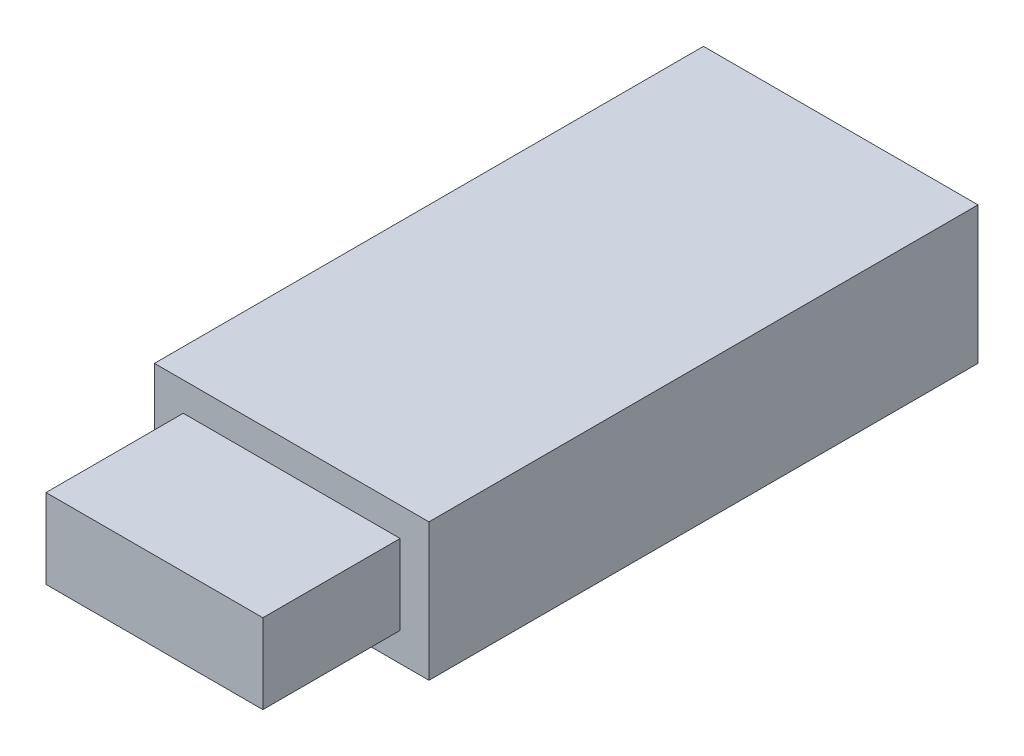
ISO-10303-21;
HEADER;
FILE_DESCRIPTION(('STEP AP214'),'2;1');
FILE_NAME('part.step','',(''),(''),'','','');
FILE_SCHEMA(('AUTOMOTIVE_DESIGN { 1 0 10303 214 1 1 1 1 }'));
ENDSEC;
DATA;
#1=APPLICATION_CONTEXT('core data for automotive mechanical design processes');
#2=APPLICATION_PROTOCOL_DEFINITION('international standard','automotive_design',2000,#1);
#3=PRODUCT_CONTEXT('',#1,'mechanical');
#4=PRODUCT('Part','Part','',(#3));
#5=PRODUCT_RELATED_PRODUCT_CATEGORY('part','',(#4));
#6=PRODUCT_DEFINITION_FORMATION('','',#4);
#7=PRODUCT_DEFINITION_CONTEXT('part definition',#1,'design');
#8=PRODUCT_DEFINITION('design','',#6,#7);
#9=PRODUCT_DEFINITION_SHAPE('','',#8);
#10=(LENGTH_UNIT() NAMED_UNIT(*) SI_UNIT(.MILLI.,.METRE.));
#11=(NAMED_UNIT(*) PLANE_ANGLE_UNIT() SI_UNIT($,.RADIAN.));
#12=(NAMED_UNIT(*) SI_UNIT($,.STERADIAN.) SOLID_ANGLE_UNIT());
#13=UNCERTAINTY_MEASURE_WITH_UNIT(LENGTH_MEASURE(1.E-05),#10,'distance_accuracy_value','');
#14=(GEOMETRIC_REPRESENTATION_CONTEXT(3) GLOBAL_UNCERTAINTY_ASSIGNED_CONTEXT((#13)) GLOBAL_UNIT_ASSIGNED_CONTEXT((#10,
#11,#12)) REPRESENTATION_CONTEXT('',''));
#15=CARTESIAN_POINT('',(0.,0.,0.));
#16=DIRECTION('',(0.,0.,1.));
#17=DIRECTION('',(1.,0.,0.));
#18=AXIS2_PLACEMENT_3D('',#15,#16,#17);
#19=CARTESIAN_POINT('',(-20.,10.,100.));
#20=DIRECTION('',(1.,0.,0.));
#21=DIRECTION('',(0.,1.,0.));
#22=AXIS2_PLACEMENT_3D('',#19,#20,#21);
#23=PLANE('',#22);
#24=DIRECTION('',(0.,-1.,0.));
#25=VECTOR('',#24,1.);
#26=CARTESIAN_POINT('',(-20.,0.,80.));
#27=LINE('',#26,#25);
#28=CARTESIAN_POINT('',(-20.,10.,80.));
#29=VERTEX_POINT('',#28);
#30=CARTESIAN_POINT('',(-20.,-10.,80.));
#31=VERTEX_POINT('',#30);
#32=EDGE_CURVE('E98',#29,#31,#27,.T.);
#33=ORIENTED_EDGE('',*,*,#32,.F.);
#34=DIRECTION('',(0.,0.,-1.));
#35=VECTOR('',#34,1.);
#36=CARTESIAN_POINT('',(-20.,10.,100.));
#37=LINE('',#36,#35);
#38=CARTESIAN_POINT('',(-20.,10.,0.));
#39=VERTEX_POINT('',#38);
#40=EDGE_CURVE('E108',#29,#39,#37,.T.);
#41=ORIENTED_EDGE('',*,*,#40,.T.);
#42=DIRECTION('',(0.,-1.,0.));
#43=VECTOR('',#42,1.);
#44=CARTESIAN_POINT('',(-20.,10.,0.));
#45=LINE('',#44,#43);
#46=CARTESIAN_POINT('',(-20.,-10.,0.));
#47=VERTEX_POINT('',#46);
#48=EDGE_CURVE('E133',#39,#47,#45,.T.);
#49=ORIENTED_EDGE('',*,*,#48,.T.);
#50=DIRECTION('',(0.,0.,-1.));
#51=VECTOR('',#50,1.);
#52=CARTESIAN_POINT('',(-20.,-10.,100.));
#53=LINE('',#52,#51);
#54=EDGE_CURVE('E11',#31,#47,#53,.T.);
#55=ORIENTED_EDGE('',*,*,#54,.F.);
#56=EDGE_LOOP('',(#33,#41,#49,#55));
#57=FACE_BOUND('',#56,.T.);
#58=ADVANCED_FACE('F34',(#57),#23,.F.);
#59=CARTESIAN_POINT('',(-20.,-10.,100.));
#60=DIRECTION('',(0.,1.,0.));
#61=DIRECTION('',(0.,0.,1.));
#62=AXIS2_PLACEMENT_3D('',#59,#60,#61);
#63=PLANE('',#62);
#64=DIRECTION('',(1.,0.,0.));
#65=VECTOR('',#64,1.);
#66=CARTESIAN_POINT('',(0.,-10.,80.));
#67=LINE('',#66,#65);
#68=CARTESIAN_POINT('',(20.,-10.,80.));
#69=VERTEX_POINT('',#68);
#70=EDGE_CURVE('E110',#31,#69,#67,.T.);
#71=ORIENTED_EDGE('',*,*,#70,.F.);
#72=ORIENTED_EDGE('',*,*,#54,.T.);
#73=DIRECTION('',(1.,0.,0.));
#74=VECTOR('',#73,1.);
#75=CARTESIAN_POINT('',(-20.,-10.,0.));
#76=LINE('',#75,#74);
#77=CARTESIAN_POINT('',(20.,-10.,0.));
#78=VERTEX_POINT('',#77);
#79=EDGE_CURVE('E130',#47,#78,#76,.T.);
#80=ORIENTED_EDGE('',*,*,#79,.T.);
#81=DIRECTION('',(0.,0.,-1.));
#82=VECTOR('',#81,1.);
#83=CARTESIAN_POINT('',(20.,-10.,100.));
#84=LINE('',#83,#82);
#85=EDGE_CURVE('E41',#69,#78,#84,.T.);
#86=ORIENTED_EDGE('',*,*,#85,.F.);
#87=EDGE_LOOP('',(#71,#72,#80,#86));
#88=FACE_BOUND('',#87,.T.);
#89=ADVANCED_FACE('F131',(#88),#63,.F.);
#90=CARTESIAN_POINT('',(20.,10.,100.));
#91=DIRECTION('',(-1.,0.,0.));
#92=DIRECTION('',(0.,-1.,0.));
#93=AXIS2_PLACEMENT_3D('',#90,#91,#92);
#94=PLANE('',#93);
#95=DIRECTION('',(0.,1.,0.));
#96=VECTOR('',#95,1.);
#97=CARTESIAN_POINT('',(20.,0.,80.));
#98=LINE('',#97,#96);
#99=CARTESIAN_POINT('',(20.,10.,80.));
#100=VERTEX_POINT('',#99);
#101=EDGE_CURVE('E48',#69,#100,#98,.T.);
#102=ORIENTED_EDGE('',*,*,#101,.F.);
#103=ORIENTED_EDGE('',*,*,#85,.T.);
#104=DIRECTION('',(0.,1.,0.));
#105=VECTOR('',#104,1.);
#106=CARTESIAN_POINT('',(20.,10.,0.));
#107=LINE('',#106,#105);
#108=CARTESIAN_POINT('',(20.,10.,0.));
#109=VERTEX_POINT('',#108);
#110=EDGE_CURVE('E119',#78,#109,#107,.T.);
#111=ORIENTED_EDGE('',*,*,#110,.T.);
#112=DIRECTION('',(0.,0.,-1.));
#113=VECTOR('',#112,1.);
#114=CARTESIAN_POINT('',(20.,10.,100.));
#115=LINE('',#114,#113);
#116=EDGE_CURVE('E116',#100,#109,#115,.T.);
#117=ORIENTED_EDGE('',*,*,#116,.F.);
#118=EDGE_LOOP('',(#102,#103,#111,#117));
#119=FACE_BOUND('',#118,.T.);
#120=ADVANCED_FACE('F126',(#119),#94,.F.);
#121=CARTESIAN_POINT('',(-20.,10.,100.));
#122=DIRECTION('',(0.,-1.,0.));
#123=DIRECTION('',(0.,0.,-1.));
#124=AXIS2_PLACEMENT_3D('',#121,#122,#123);
#125=PLANE('',#124);
#126=DIRECTION('',(-1.,0.,0.));
#127=VECTOR('',#126,1.);
#128=CARTESIAN_POINT('',(0.,10.,80.));
#129=LINE('',#128,#127);
#130=EDGE_CURVE('E94',#100,#29,#129,.T.);
#131=ORIENTED_EDGE('',*,*,#130,.F.);
#132=ORIENTED_EDGE('',*,*,#116,.T.);
#133=DIRECTION('',(-1.,0.,0.));
#134=VECTOR('',#133,1.);
#135=CARTESIAN_POINT('',(-20.,10.,0.));
#136=LINE('',#135,#134);
#137=EDGE_CURVE('E114',#109,#39,#136,.T.);
#138=ORIENTED_EDGE('',*,*,#137,.T.);
#139=ORIENTED_EDGE('',*,*,#40,.F.);
#140=EDGE_LOOP('',(#131,#132,#138,#139));
#141=FACE_BOUND('',#140,.T.);
#142=ADVANCED_FACE('F112',(#141),#125,.F.);
#143=CARTESIAN_POINT('',(0.,0.,0.));
#144=DIRECTION('',(0.,0.,1.));
#145=DIRECTION('',(1.,0.,0.));
#146=AXIS2_PLACEMENT_3D('',#143,#144,#145);
#147=PLANE('',#146);
#148=ORIENTED_EDGE('',*,*,#48,.F.);
#149=ORIENTED_EDGE('',*,*,#137,.F.);
#150=ORIENTED_EDGE('',*,*,#110,.F.);
#151=ORIENTED_EDGE('',*,*,#79,.F.);
#152=EDGE_LOOP('',(#148,#149,#150,#151));
#153=FACE_BOUND('',#152,.T.);
#154=ADVANCED_FACE('F135',(#153),#147,.F.);
#155=CARTESIAN_POINT('',(0.,5.8,80.));
#156=DIRECTION('',(0.,-1.,0.));
#157=DIRECTION('',(0.,0.,-1.));
#158=AXIS2_PLACEMENT_3D('',#155,#156,#157);
#159=PLANE('',#158);
#160=DIRECTION('',(1.,0.,0.));
#161=VECTOR('',#160,1.);
#162=CARTESIAN_POINT('',(0.,5.8,100.));
#163=LINE('',#162,#161);
#164=CARTESIAN_POINT('',(-15.8,5.8,100.));
#165=VERTEX_POINT('',#164);
#166=CARTESIAN_POINT('',(15.8,5.8,100.));
#167=VERTEX_POINT('',#166);
#168=EDGE_CURVE('E56',#165,#167,#163,.T.);
#169=ORIENTED_EDGE('',*,*,#168,.T.);
#170=DIRECTION('',(0.,0.,1.));
#171=VECTOR('',#170,1.);
#172=CARTESIAN_POINT('',(15.8,5.8,80.));
#173=LINE('',#172,#171);
#174=CARTESIAN_POINT('',(15.8,5.8,80.));
#175=VERTEX_POINT('',#174);
#176=EDGE_CURVE('E139',#175,#167,#173,.T.);
#177=ORIENTED_EDGE('',*,*,#176,.F.);
#178=DIRECTION('',(1.,0.,0.));
#179=VECTOR('',#178,1.);
#180=CARTESIAN_POINT('',(0.,5.8,80.));
#181=LINE('',#180,#179);
#182=CARTESIAN_POINT('',(-15.8,5.8,80.));
#183=VERTEX_POINT('',#182);
#184=EDGE_CURVE('E164',#183,#175,#181,.T.);
#185=ORIENTED_EDGE('',*,*,#184,.F.);
#186=DIRECTION('',(0.,0.,1.));
#187=VECTOR('',#186,1.);
#188=CARTESIAN_POINT('',(-15.8,5.8,80.));
#189=LINE('',#188,#187);
#190=EDGE_CURVE('E138',#183,#165,#189,.T.);
#191=ORIENTED_EDGE('',*,*,#190,.T.);
#192=EDGE_LOOP('',(#169,#177,#185,#191));
#193=FACE_BOUND('',#192,.T.);
#194=ADVANCED_FACE('F171',(#193),#159,.F.);
#195=CARTESIAN_POINT('',(-15.8,0.,80.));
#196=DIRECTION('',(-1.,0.,0.));
#197=DIRECTION('',(0.,0.,1.));
#198=AXIS2_PLACEMENT_3D('',#195,#196,#197);
#199=PLANE('',#198);
#200=DIRECTION('',(0.,-1.,0.));
#201=VECTOR('',#200,1.);
#202=CARTESIAN_POINT('',(-15.8,0.,100.));
#203=LINE('',#202,#201);
#204=CARTESIAN_POINT('',(-15.8,-5.8,100.));
#205=VERTEX_POINT('',#204);
#206=EDGE_CURVE('E103',#165,#205,#203,.T.);
#207=ORIENTED_EDGE('',*,*,#206,.F.);
#208=ORIENTED_EDGE('',*,*,#190,.F.);
#209=DIRECTION('',(0.,-1.,0.));
#210=VECTOR('',#209,1.);
#211=CARTESIAN_POINT('',(-15.8,0.,80.));
#212=LINE('',#211,#210);
#213=CARTESIAN_POINT('',(-15.8,-5.8,80.));
#214=VERTEX_POINT('',#213);
#215=EDGE_CURVE('E142',#183,#214,#212,.T.);
#216=ORIENTED_EDGE('',*,*,#215,.T.);
#217=DIRECTION('',(0.,0.,1.));
#218=VECTOR('',#217,1.);
#219=CARTESIAN_POINT('',(-15.8,-5.8,80.));
#220=LINE('',#219,#218);
#221=EDGE_CURVE('E144',#214,#205,#220,.T.);
#222=ORIENTED_EDGE('',*,*,#221,.T.);
#223=EDGE_LOOP('',(#207,#208,#216,#222));
#224=FACE_BOUND('',#223,.T.);
#225=ADVANCED_FACE('F181',(#224),#199,.T.);
#226=CARTESIAN_POINT('',(0.,-5.8,80.));
#227=DIRECTION('',(0.,-1.,0.));
#228=DIRECTION('',(0.,0.,-1.));
#229=AXIS2_PLACEMENT_3D('',#226,#227,#228);
#230=PLANE('',#229);
#231=DIRECTION('',(1.,0.,0.));
#232=VECTOR('',#231,1.);
#233=CARTESIAN_POINT('',(0.,-5.8,100.));
#234=LINE('',#233,#232);
#235=CARTESIAN_POINT('',(15.8,-5.8,100.));
#236=VERTEX_POINT('',#235);
#237=EDGE_CURVE('E150',#205,#236,#234,.T.);
#238=ORIENTED_EDGE('',*,*,#237,.F.);
#239=ORIENTED_EDGE('',*,*,#221,.F.);
#240=DIRECTION('',(1.,0.,0.));
#241=VECTOR('',#240,1.);
#242=CARTESIAN_POINT('',(0.,-5.8,80.));
#243=LINE('',#242,#241);
#244=CARTESIAN_POINT('',(15.8,-5.8,80.));
#245=VERTEX_POINT('',#244);
#246=EDGE_CURVE('E159',#214,#245,#243,.T.);
#247=ORIENTED_EDGE('',*,*,#246,.T.);
#248=DIRECTION('',(0.,0.,1.));
#249=VECTOR('',#248,1.);
#250=CARTESIAN_POINT('',(15.8,-5.8,80.));
#251=LINE('',#250,#249);
#252=EDGE_CURVE('E141',#245,#236,#251,.T.);
#253=ORIENTED_EDGE('',*,*,#252,.T.);
#254=EDGE_LOOP('',(#238,#239,#247,#253));
#255=FACE_BOUND('',#254,.T.);
#256=ADVANCED_FACE('F178',(#255),#230,.T.);
#257=CARTESIAN_POINT('',(15.8,0.,80.));
#258=DIRECTION('',(-1.,0.,0.));
#259=DIRECTION('',(0.,-1.,0.));
#260=AXIS2_PLACEMENT_3D('',#257,#258,#259);
#261=PLANE('',#260);
#262=DIRECTION('',(0.,-1.,0.));
#263=VECTOR('',#262,1.);
#264=CARTESIAN_POINT('',(15.8,0.,100.));
#265=LINE('',#264,#263);
#266=EDGE_CURVE('E153',#167,#236,#265,.T.);
#267=ORIENTED_EDGE('',*,*,#266,.T.);
#268=ORIENTED_EDGE('',*,*,#252,.F.);
#269=DIRECTION('',(0.,-1.,0.));
#270=VECTOR('',#269,1.);
#271=CARTESIAN_POINT('',(15.8,0.,80.));
#272=LINE('',#271,#270);
#273=EDGE_CURVE('E161',#175,#245,#272,.T.);
#274=ORIENTED_EDGE('',*,*,#273,.F.);
#275=ORIENTED_EDGE('',*,*,#176,.T.);
#276=EDGE_LOOP('',(#267,#268,#274,#275));
#277=FACE_BOUND('',#276,.T.);
#278=ADVANCED_FACE('F176',(#277),#261,.F.);
#279=CARTESIAN_POINT('',(0.,0.,80.));
#280=DIRECTION('',(0.,0.,1.));
#281=DIRECTION('',(1.,0.,0.));
#282=AXIS2_PLACEMENT_3D('',#279,#280,#281);
#283=PLANE('',#282);
#284=ORIENTED_EDGE('',*,*,#130,.T.);
#285=ORIENTED_EDGE('',*,*,#32,.T.);
#286=ORIENTED_EDGE('',*,*,#70,.T.);
#287=ORIENTED_EDGE('',*,*,#101,.T.);
#288=EDGE_LOOP('',(#284,#285,#286,#287));
#289=FACE_BOUND('',#288,.T.);
#290=ORIENTED_EDGE('',*,*,#184,.T.);
#291=ORIENTED_EDGE('',*,*,#273,.T.);
#292=ORIENTED_EDGE('',*,*,#246,.F.);
#293=ORIENTED_EDGE('',*,*,#215,.F.);
#294=EDGE_LOOP('',(#290,#291,#292,#293));
#295=FACE_BOUND('',#294,.T.);
#296=ADVANCED_FACE('F96',(#289,#295),#283,.T.);
#297=CARTESIAN_POINT('',(0.,0.,100.));
#298=DIRECTION('',(0.,0.,1.));
#299=DIRECTION('',(1.,0.,0.));
#300=AXIS2_PLACEMENT_3D('',#297,#298,#299);
#301=PLANE('',#300);
#302=ORIENTED_EDGE('',*,*,#168,.F.);
#303=ORIENTED_EDGE('',*,*,#206,.T.);
#304=ORIENTED_EDGE('',*,*,#237,.T.);
#305=ORIENTED_EDGE('',*,*,#266,.F.);
#306=EDGE_LOOP('',(#302,#303,#304,#305));
#307=FACE_BOUND('',#306,.T.);
#308=ADVANCED_FACE('F183',(#307),#301,.T.);
#309=CLOSED_SHELL('',(#58,#89,#120,#142,#154,#194,#225,#256,#278,#296,#308));
#310=MANIFOLD_SOLID_BREP('B2',#309);
#311=ADVANCED_BREP_SHAPE_REPRESENTATION('',(#18,#310),#14);
#312=SHAPE_DEFINITION_REPRESENTATION(#9,#311);
ENDSEC;
END-ISO-10303-21;
